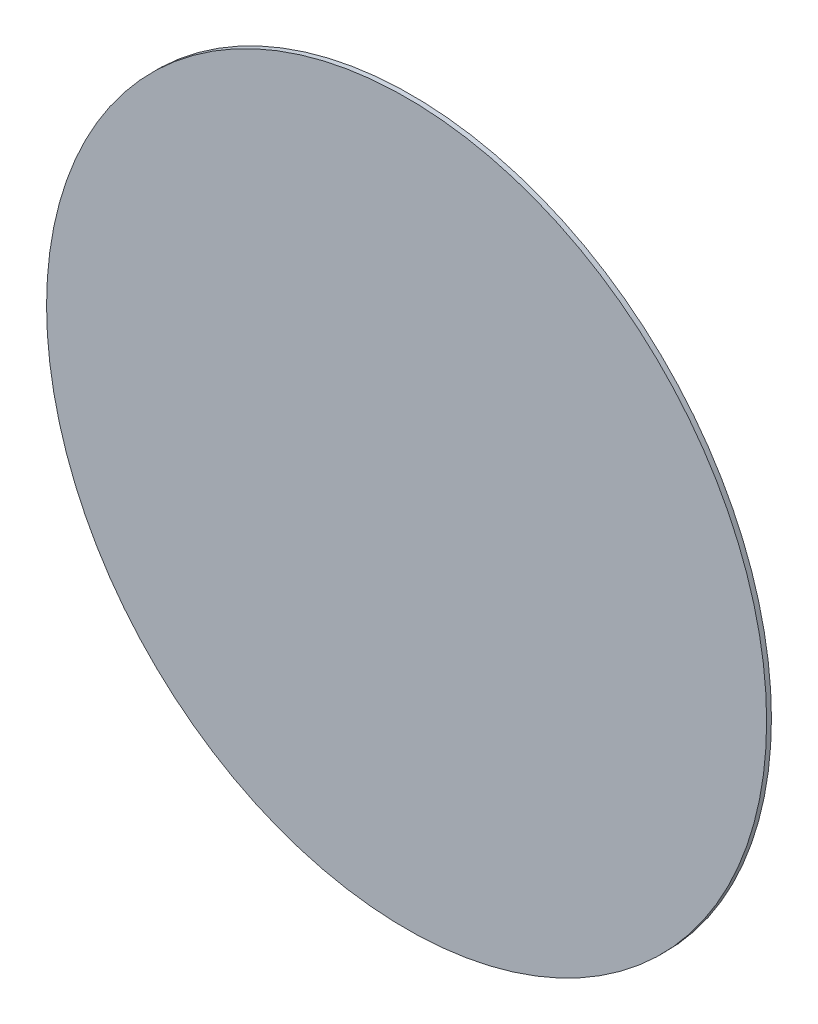
ISO-10303-21;
HEADER;
FILE_DESCRIPTION(('STEP AP214'),'2;1');
FILE_NAME('part.step','',(''),(''),'','','');
FILE_SCHEMA(('AUTOMOTIVE_DESIGN { 1 0 10303 214 1 1 1 1 }'));
ENDSEC;
DATA;
#1=APPLICATION_CONTEXT('core data for automotive mechanical design processes');
#2=APPLICATION_PROTOCOL_DEFINITION('international standard','automotive_design',2000,#1);
#3=PRODUCT_CONTEXT('',#1,'mechanical');
#4=PRODUCT('Part','Part','',(#3));
#5=PRODUCT_RELATED_PRODUCT_CATEGORY('part','',(#4));
#6=PRODUCT_DEFINITION_FORMATION('','',#4);
#7=PRODUCT_DEFINITION_CONTEXT('part definition',#1,'design');
#8=PRODUCT_DEFINITION('design','',#6,#7);
#9=PRODUCT_DEFINITION_SHAPE('','',#8);
#10=(LENGTH_UNIT() NAMED_UNIT(*) SI_UNIT(.MILLI.,.METRE.));
#11=(NAMED_UNIT(*) PLANE_ANGLE_UNIT() SI_UNIT($,.RADIAN.));
#12=(NAMED_UNIT(*) SI_UNIT($,.STERADIAN.) SOLID_ANGLE_UNIT());
#13=UNCERTAINTY_MEASURE_WITH_UNIT(LENGTH_MEASURE(1.E-05),#10,'distance_accuracy_value','');
#14=(GEOMETRIC_REPRESENTATION_CONTEXT(3) GLOBAL_UNCERTAINTY_ASSIGNED_CONTEXT((#13)) GLOBAL_UNIT_ASSIGNED_CONTEXT((#10,
#11,#12)) REPRESENTATION_CONTEXT('',''));
#15=CARTESIAN_POINT('',(0.,0.,0.));
#16=DIRECTION('',(0.,0.,1.));
#17=DIRECTION('',(1.,0.,0.));
#18=AXIS2_PLACEMENT_3D('',#15,#16,#17);
#19=CARTESIAN_POINT('',(-3.6,3.6,0.8));
#20=DIRECTION('',(0.,0.,1.));
#21=DIRECTION('',(1.,0.,0.));
#22=AXIS2_PLACEMENT_3D('',#19,#20,#21);
#23=CYLINDRICAL_SURFACE('',#22,0.2249999945);
#24=CARTESIAN_POINT('',(-3.6,3.6,0.803));
#25=DIRECTION('',(0.,0.,1.));
#26=DIRECTION('',(1.,0.,0.));
#27=AXIS2_PLACEMENT_3D('',#24,#25,#26);
#28=CIRCLE('',#27,0.2249999945);
#29=CARTESIAN_POINT('',(-3.825,3.6,0.803));
#30=VERTEX_POINT('',#29);
#31=EDGE_CURVE('E11',#30,#30,#28,.T.);
#32=ORIENTED_EDGE('',*,*,#31,.F.);
#33=CARTESIAN_POINT('',(-3.8249999945,3.6,0.8));
#34=CARTESIAN_POINT('',(-3.8249999945,3.6,0.803));
#35=B_SPLINE_CURVE_WITH_KNOTS('',1,(#33,#34),.UNSPECIFIED.,.F.,.F.,(2,2),(0.,0.003),.UNSPECIFIED.);
#36=CARTESIAN_POINT('',(-3.825,3.6,0.8));
#37=VERTEX_POINT('',#36);
#38=EDGE_CURVE('E24',#37,#30,#35,.T.);
#39=ORIENTED_EDGE('',*,*,#38,.F.);
#40=CARTESIAN_POINT('',(-3.6,3.6,0.8));
#41=DIRECTION('',(0.,0.,-1.));
#42=DIRECTION('',(1.,0.,0.));
#43=AXIS2_PLACEMENT_3D('',#40,#41,#42);
#44=CIRCLE('',#43,0.2249999945);
#45=EDGE_CURVE('E33',#37,#37,#44,.T.);
#46=ORIENTED_EDGE('',*,*,#45,.F.);
#47=ORIENTED_EDGE('',*,*,#38,.T.);
#48=EDGE_LOOP('',(#32,#39,#46,#47));
#49=FACE_BOUND('',#48,.T.);
#50=ADVANCED_FACE('F17',(#49),#23,.T.);
#51=CARTESIAN_POINT('',(-3.6,3.6,0.8));
#52=DIRECTION('',(0.,0.,1.));
#53=DIRECTION('',(0.,1.,0.));
#54=AXIS2_PLACEMENT_3D('',#51,#52,#53);
#55=PLANE('',#54);
#56=ORIENTED_EDGE('',*,*,#45,.T.);
#57=EDGE_LOOP('',(#56));
#58=FACE_BOUND('',#57,.T.);
#59=ADVANCED_FACE('F35',(#58),#55,.F.);
#60=CARTESIAN_POINT('',(-3.6,3.6,0.803));
#61=DIRECTION('',(0.,0.,1.));
#62=DIRECTION('',(0.,1.,0.));
#63=AXIS2_PLACEMENT_3D('',#60,#61,#62);
#64=PLANE('',#63);
#65=ORIENTED_EDGE('',*,*,#31,.T.);
#66=EDGE_LOOP('',(#65));
#67=FACE_BOUND('',#66,.T.);
#68=ADVANCED_FACE('F43',(#67),#64,.T.);
#69=CLOSED_SHELL('',(#50,#59,#68));
#70=MANIFOLD_SOLID_BREP('B1',#69);
#71=ADVANCED_BREP_SHAPE_REPRESENTATION('',(#18,#70),#14);
#72=SHAPE_DEFINITION_REPRESENTATION(#9,#71);
ENDSEC;
END-ISO-10303-21;
